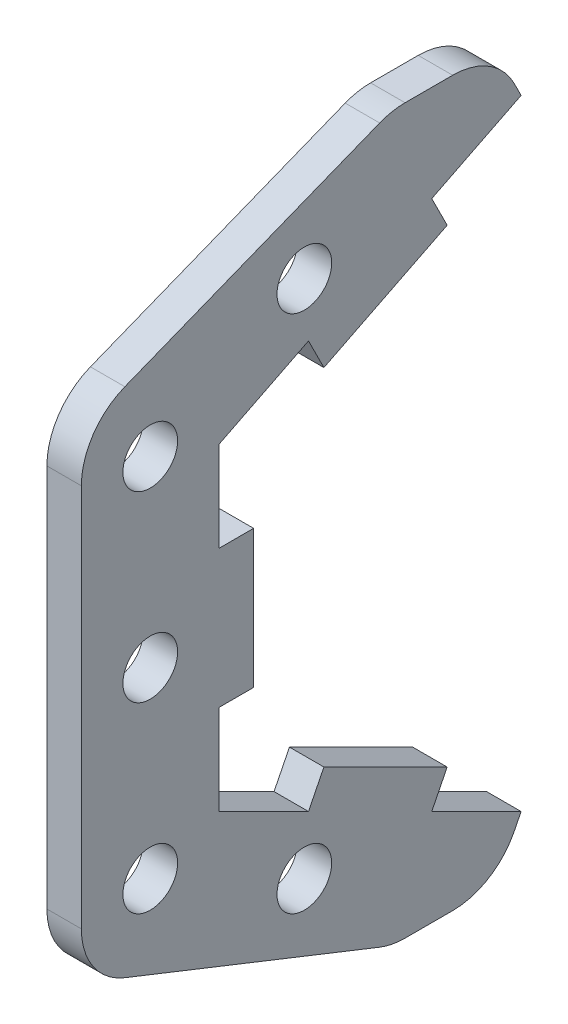
ISO-10303-21;
HEADER;
FILE_DESCRIPTION(('STEP AP214'),'2;1');
FILE_NAME('part.step','',(''),(''),'','','');
FILE_SCHEMA(('AUTOMOTIVE_DESIGN { 1 0 10303 214 1 1 1 1 }'));
ENDSEC;
DATA;
#1=APPLICATION_CONTEXT('core data for automotive mechanical design processes');
#2=APPLICATION_PROTOCOL_DEFINITION('international standard','automotive_design',2000,#1);
#3=PRODUCT_CONTEXT('',#1,'mechanical');
#4=PRODUCT('Part','Part','',(#3));
#5=PRODUCT_RELATED_PRODUCT_CATEGORY('part','',(#4));
#6=PRODUCT_DEFINITION_FORMATION('','',#4);
#7=PRODUCT_DEFINITION_CONTEXT('part definition',#1,'design');
#8=PRODUCT_DEFINITION('design','',#6,#7);
#9=PRODUCT_DEFINITION_SHAPE('','',#8);
#10=(LENGTH_UNIT() NAMED_UNIT(*) SI_UNIT(.MILLI.,.METRE.));
#11=(NAMED_UNIT(*) PLANE_ANGLE_UNIT() SI_UNIT($,.RADIAN.));
#12=(NAMED_UNIT(*) SI_UNIT($,.STERADIAN.) SOLID_ANGLE_UNIT());
#13=UNCERTAINTY_MEASURE_WITH_UNIT(LENGTH_MEASURE(1.E-05),#10,'distance_accuracy_value','');
#14=(GEOMETRIC_REPRESENTATION_CONTEXT(3) GLOBAL_UNCERTAINTY_ASSIGNED_CONTEXT((#13)) GLOBAL_UNIT_ASSIGNED_CONTEXT((#10,
#11,#12)) REPRESENTATION_CONTEXT('',''));
#15=CARTESIAN_POINT('',(0.,0.,0.));
#16=DIRECTION('',(0.,0.,1.));
#17=DIRECTION('',(1.,0.,0.));
#18=AXIS2_PLACEMENT_3D('',#15,#16,#17);
#19=CARTESIAN_POINT('',(6.35,110.581612662849,55.2908063314247));
#20=DIRECTION('',(0.,0.894427190999916,0.447213595499958));
#21=DIRECTION('',(0.,-0.447213595499958,0.894427190999916));
#22=AXIS2_PLACEMENT_3D('',#19,#20,#21);
#23=PLANE('',#22);
#24=DIRECTION('',(0.,-0.447213595499958,0.894427190999916));
#25=VECTOR('',#24,1.);
#26=CARTESIAN_POINT('',(12.7,110.581612662849,55.2908063314247));
#27=LINE('',#26,#25);
#28=CARTESIAN_POINT('',(12.7,57.15,162.154031657124));
#29=VERTEX_POINT('',#28);
#30=CARTESIAN_POINT('',(12.7,48.9168705771304,178.620290502863));
#31=VERTEX_POINT('',#30);
#32=EDGE_CURVE('E230',#29,#31,#27,.T.);
#33=ORIENTED_EDGE('',*,*,#32,.T.);
#34=DIRECTION('',(1.,0.,0.));
#35=VECTOR('',#34,1.);
#36=CARTESIAN_POINT('',(-24.3672020210175,48.9168705771304,178.620290502863));
#37=LINE('',#36,#35);
#38=CARTESIAN_POINT('',(6.35,48.9168705771304,178.620290502863));
#39=VERTEX_POINT('',#38);
#40=EDGE_CURVE('E58',#39,#31,#37,.T.);
#41=ORIENTED_EDGE('',*,*,#40,.F.);
#42=DIRECTION('',(0.,-0.447213595499958,0.894427190999916));
#43=VECTOR('',#42,1.);
#44=CARTESIAN_POINT('',(6.35,110.581612662849,55.2908063314247));
#45=LINE('',#44,#43);
#46=CARTESIAN_POINT('',(6.35,57.15,162.154031657124));
#47=VERTEX_POINT('',#46);
#48=EDGE_CURVE('E359',#47,#39,#45,.T.);
#49=ORIENTED_EDGE('',*,*,#48,.F.);
#50=DIRECTION('',(1.,0.,0.));
#51=VECTOR('',#50,1.);
#52=CARTESIAN_POINT('',(6.35,57.15,162.154031657124));
#53=LINE('',#52,#51);
#54=EDGE_CURVE('E397',#47,#29,#53,.T.);
#55=ORIENTED_EDGE('',*,*,#54,.T.);
#56=EDGE_LOOP('',(#33,#41,#49,#55));
#57=FACE_BOUND('',#56,.T.);
#58=ADVANCED_FACE('F35',(#57),#23,.F.);
#59=CARTESIAN_POINT('',(6.35,-110.581612662849,55.2908063314247));
#60=DIRECTION('',(0.,-0.894427190999916,0.447213595499958));
#61=DIRECTION('',(0.,-0.447213595499958,-0.894427190999916));
#62=AXIS2_PLACEMENT_3D('',#59,#60,#61);
#63=PLANE('',#62);
#64=DIRECTION('',(0.,-0.447213595499958,-0.894427190999916));
#65=VECTOR('',#64,1.);
#66=CARTESIAN_POINT('',(12.7,-110.581612662849,55.2908063314247));
#67=LINE('',#66,#65);
#68=CARTESIAN_POINT('',(12.7,-29.3245158285618,217.805));
#69=VERTEX_POINT('',#68);
#70=CARTESIAN_POINT('',(12.7,-37.5576452514315,201.338741154261));
#71=VERTEX_POINT('',#70);
#72=EDGE_CURVE('E383',#69,#71,#67,.T.);
#73=ORIENTED_EDGE('',*,*,#72,.T.);
#74=DIRECTION('',(1.,0.,0.));
#75=VECTOR('',#74,1.);
#76=CARTESIAN_POINT('',(-24.3672020210175,-37.5576452514315,201.338741154261));
#77=LINE('',#76,#75);
#78=CARTESIAN_POINT('',(6.35,-37.5576452514315,201.338741154261));
#79=VERTEX_POINT('',#78);
#80=EDGE_CURVE('E263',#79,#71,#77,.T.);
#81=ORIENTED_EDGE('',*,*,#80,.F.);
#82=DIRECTION('',(0.,-0.447213595499958,-0.894427190999916));
#83=VECTOR('',#82,1.);
#84=CARTESIAN_POINT('',(6.35,-110.581612662849,55.2908063314247));
#85=LINE('',#84,#83);
#86=CARTESIAN_POINT('',(6.35,-29.3245158285618,217.805));
#87=VERTEX_POINT('',#86);
#88=EDGE_CURVE('E352',#87,#79,#85,.T.);
#89=ORIENTED_EDGE('',*,*,#88,.F.);
#90=DIRECTION('',(1.,0.,0.));
#91=VECTOR('',#90,1.);
#92=CARTESIAN_POINT('',(6.35,-29.3245158285618,217.805));
#93=LINE('',#92,#91);
#94=EDGE_CURVE('E402',#87,#69,#93,.T.);
#95=ORIENTED_EDGE('',*,*,#94,.T.);
#96=EDGE_LOOP('',(#73,#81,#89,#95));
#97=FACE_BOUND('',#96,.T.);
#98=ADVANCED_FACE('F536',(#97),#63,.F.);
#99=CARTESIAN_POINT('',(6.35,0.,217.805));
#100=DIRECTION('',(0.,0.,1.));
#101=DIRECTION('',(1.,0.,0.));
#102=AXIS2_PLACEMENT_3D('',#99,#100,#101);
#103=PLANE('',#102);
#104=DIRECTION('',(0.,-1.,0.));
#105=VECTOR('',#104,1.);
#106=CARTESIAN_POINT('',(12.7,0.,217.805));
#107=LINE('',#106,#105);
#108=CARTESIAN_POINT('',(12.7,29.3245158285619,217.805));
#109=VERTEX_POINT('',#108);
#110=CARTESIAN_POINT('',(12.7,12.7,217.805));
#111=VERTEX_POINT('',#110);
#112=EDGE_CURVE('E228',#109,#111,#107,.T.);
#113=ORIENTED_EDGE('',*,*,#112,.T.);
#114=DIRECTION('',(1.,0.,0.));
#115=VECTOR('',#114,1.);
#116=CARTESIAN_POINT('',(-24.3672020210175,12.7,217.805));
#117=LINE('',#116,#115);
#118=CARTESIAN_POINT('',(6.35,12.7,217.805));
#119=VERTEX_POINT('',#118);
#120=EDGE_CURVE('E289',#119,#111,#117,.T.);
#121=ORIENTED_EDGE('',*,*,#120,.F.);
#122=DIRECTION('',(0.,-1.,0.));
#123=VECTOR('',#122,1.);
#124=CARTESIAN_POINT('',(6.35,0.,217.805));
#125=LINE('',#124,#123);
#126=CARTESIAN_POINT('',(6.35,29.3245158285619,217.805));
#127=VERTEX_POINT('',#126);
#128=EDGE_CURVE('E356',#127,#119,#125,.T.);
#129=ORIENTED_EDGE('',*,*,#128,.F.);
#130=DIRECTION('',(1.,0.,0.));
#131=VECTOR('',#130,1.);
#132=CARTESIAN_POINT('',(6.35,29.3245158285619,217.805));
#133=LINE('',#132,#131);
#134=EDGE_CURVE('E400',#127,#109,#133,.T.);
#135=ORIENTED_EDGE('',*,*,#134,.T.);
#136=EDGE_LOOP('',(#113,#121,#129,#135));
#137=FACE_BOUND('',#136,.T.);
#138=ADVANCED_FACE('F556',(#137),#103,.F.);
#139=CARTESIAN_POINT('',(6.35,-121.32277142173,48.0848399848919));
#140=DIRECTION('',(0.,-0.929645930646482,0.368454126903793));
#141=DIRECTION('',(0.,-0.368454126903793,-0.929645930646482));
#142=AXIS2_PLACEMENT_3D('',#139,#140,#141);
#143=PLANE('',#142);
#144=DIRECTION('',(0.,-0.368454126903794,-0.929645930646482));
#145=VECTOR('',#144,1.);
#146=CARTESIAN_POINT('',(12.7,-121.32277142173,48.0848399848919));
#147=LINE('',#146,#145);
#148=CARTESIAN_POINT('',(12.7,-47.1680951632006,235.184367411678));
#149=VERTEX_POINT('',#148);
#150=CARTESIAN_POINT('',(12.7,-65.7815033192103,188.220911490842));
#151=VERTEX_POINT('',#150);
#152=EDGE_CURVE('E340',#149,#151,#147,.T.);
#153=ORIENTED_EDGE('',*,*,#152,.F.);
#154=DIRECTION('',(1.,0.,0.));
#155=VECTOR('',#154,1.);
#156=CARTESIAN_POINT('',(6.35,-47.1680951632006,235.184367411678));
#157=LINE('',#156,#155);
#158=CARTESIAN_POINT('',(6.35,-47.1680951632006,235.184367411678));
#159=VERTEX_POINT('',#158);
#160=EDGE_CURVE('E443',#149,#159,#157,.F.);
#161=ORIENTED_EDGE('',*,*,#160,.T.);
#162=DIRECTION('',(0.,-0.368454126903794,-0.929645930646482));
#163=VECTOR('',#162,1.);
#164=CARTESIAN_POINT('',(6.35,-121.32277142173,48.0848399848919));
#165=LINE('',#164,#163);
#166=CARTESIAN_POINT('',(6.35,-65.7815033192103,188.220911490842));
#167=VERTEX_POINT('',#166);
#168=EDGE_CURVE('E341',#159,#167,#165,.T.);
#169=ORIENTED_EDGE('',*,*,#168,.T.);
#170=DIRECTION('',(1.,0.,0.));
#171=VECTOR('',#170,1.);
#172=CARTESIAN_POINT('',(6.35,-65.7815033192103,188.220911490842));
#173=LINE('',#172,#171);
#174=EDGE_CURVE('E440',#167,#151,#173,.T.);
#175=ORIENTED_EDGE('',*,*,#174,.T.);
#176=EDGE_LOOP('',(#153,#161,#169,#175));
#177=FACE_BOUND('',#176,.T.);
#178=ADVANCED_FACE('F497',(#177),#143,.T.);
#179=CARTESIAN_POINT('',(6.35,0.,243.205));
#180=DIRECTION('',(0.,0.,1.));
#181=DIRECTION('',(1.,0.,0.));
#182=AXIS2_PLACEMENT_3D('',#179,#180,#181);
#183=PLANE('',#182);
#184=DIRECTION('',(0.,-1.,0.));
#185=VECTOR('',#184,1.);
#186=CARTESIAN_POINT('',(12.7,0.,243.205));
#187=LINE('',#186,#185);
#188=CARTESIAN_POINT('',(12.7,35.3615918439905,243.205));
#189=VERTEX_POINT('',#188);
#190=CARTESIAN_POINT('',(12.7,-35.3615918439903,243.205));
#191=VERTEX_POINT('',#190);
#192=EDGE_CURVE('E345',#189,#191,#187,.T.);
#193=ORIENTED_EDGE('',*,*,#192,.F.);
#194=DIRECTION('',(1.,0.,0.));
#195=VECTOR('',#194,1.);
#196=CARTESIAN_POINT('',(6.35,35.3615918439905,243.205));
#197=LINE('',#196,#195);
#198=CARTESIAN_POINT('',(6.35,35.3615918439905,243.205));
#199=VERTEX_POINT('',#198);
#200=EDGE_CURVE('E426',#189,#199,#197,.F.);
#201=ORIENTED_EDGE('',*,*,#200,.T.);
#202=DIRECTION('',(0.,-1.,0.));
#203=VECTOR('',#202,1.);
#204=CARTESIAN_POINT('',(6.35,0.,243.205));
#205=LINE('',#204,#203);
#206=CARTESIAN_POINT('',(6.35,-35.3615918439903,243.205));
#207=VERTEX_POINT('',#206);
#208=EDGE_CURVE('E370',#199,#207,#205,.T.);
#209=ORIENTED_EDGE('',*,*,#208,.T.);
#210=DIRECTION('',(1.,0.,0.));
#211=VECTOR('',#210,1.);
#212=CARTESIAN_POINT('',(6.35,-35.3615918439903,243.205));
#213=LINE('',#212,#211);
#214=EDGE_CURVE('E423',#207,#191,#213,.T.);
#215=ORIENTED_EDGE('',*,*,#214,.T.);
#216=EDGE_LOOP('',(#193,#201,#209,#215));
#217=FACE_BOUND('',#216,.T.);
#218=ADVANCED_FACE('F486',(#217),#183,.T.);
#219=CARTESIAN_POINT('',(6.35,121.322771421729,48.084839984891));
#220=DIRECTION('',(0.,0.929645930646483,0.368454126903789));
#221=DIRECTION('',(0.,-0.368454126903789,0.929645930646484));
#222=AXIS2_PLACEMENT_3D('',#219,#220,#221);
#223=PLANE('',#222);
#224=DIRECTION('',(0.,-0.368454126903789,0.929645930646484));
#225=VECTOR('',#224,1.);
#226=CARTESIAN_POINT('',(6.35,121.322771421729,48.084839984891));
#227=LINE('',#226,#225);
#228=CARTESIAN_POINT('',(6.35,65.7815033192103,188.220911490842));
#229=VERTEX_POINT('',#228);
#230=CARTESIAN_POINT('',(6.35,47.1680951632009,235.184367411678));
#231=VERTEX_POINT('',#230);
#232=EDGE_CURVE('E367',#229,#231,#227,.T.);
#233=ORIENTED_EDGE('',*,*,#232,.T.);
#234=DIRECTION('',(1.,0.,0.));
#235=VECTOR('',#234,1.);
#236=CARTESIAN_POINT('',(6.35,47.1680951632009,235.184367411678));
#237=LINE('',#236,#235);
#238=CARTESIAN_POINT('',(12.7,47.1680951632009,235.184367411678));
#239=VERTEX_POINT('',#238);
#240=EDGE_CURVE('E408',#231,#239,#237,.T.);
#241=ORIENTED_EDGE('',*,*,#240,.T.);
#242=DIRECTION('',(0.,-0.368454126903789,0.929645930646484));
#243=VECTOR('',#242,1.);
#244=CARTESIAN_POINT('',(12.7,121.322771421729,48.084839984891));
#245=LINE('',#244,#243);
#246=CARTESIAN_POINT('',(12.7,65.7815033192103,188.220911490842));
#247=VERTEX_POINT('',#246);
#248=EDGE_CURVE('E393',#247,#239,#245,.T.);
#249=ORIENTED_EDGE('',*,*,#248,.F.);
#250=DIRECTION('',(1.,0.,0.));
#251=VECTOR('',#250,1.);
#252=CARTESIAN_POINT('',(6.35,65.7815033192103,188.220911490842));
#253=LINE('',#252,#251);
#254=EDGE_CURVE('E399',#247,#229,#253,.F.);
#255=ORIENTED_EDGE('',*,*,#254,.T.);
#256=EDGE_LOOP('',(#233,#241,#249,#255));
#257=FACE_BOUND('',#256,.T.);
#258=ADVANCED_FACE('F480',(#257),#223,.T.);
#259=CARTESIAN_POINT('',(6.35,66.6750000000001,0.));
#260=DIRECTION('',(0.,1.,0.));
#261=DIRECTION('',(0.,0.,1.));
#262=AXIS2_PLACEMENT_3D('',#259,#260,#261);
#263=PLANE('',#262);
#264=DIRECTION('',(0.,0.,1.));
#265=VECTOR('',#264,1.);
#266=CARTESIAN_POINT('',(12.7,66.6750000000001,0.));
#267=LINE('',#266,#265);
#268=CARTESIAN_POINT('',(12.7,66.675,174.765563314247));
#269=VERTEX_POINT('',#268);
#270=CARTESIAN_POINT('',(12.7,66.6749999999999,183.541544079164));
#271=VERTEX_POINT('',#270);
#272=EDGE_CURVE('E390',#269,#271,#267,.T.);
#273=ORIENTED_EDGE('',*,*,#272,.F.);
#274=DIRECTION('',(1.,0.,0.));
#275=VECTOR('',#274,1.);
#276=CARTESIAN_POINT('',(6.35,66.675,174.765563314247));
#277=LINE('',#276,#275);
#278=CARTESIAN_POINT('',(6.35,66.675,174.765563314247));
#279=VERTEX_POINT('',#278);
#280=EDGE_CURVE('E11',#269,#279,#277,.F.);
#281=ORIENTED_EDGE('',*,*,#280,.T.);
#282=DIRECTION('',(0.,0.,1.));
#283=VECTOR('',#282,1.);
#284=CARTESIAN_POINT('',(6.35,66.6750000000001,0.));
#285=LINE('',#284,#283);
#286=CARTESIAN_POINT('',(6.35,66.6749999999999,183.541544079164));
#287=VERTEX_POINT('',#286);
#288=EDGE_CURVE('E364',#279,#287,#285,.T.);
#289=ORIENTED_EDGE('',*,*,#288,.T.);
#290=DIRECTION('',(1.,0.,0.));
#291=VECTOR('',#290,1.);
#292=CARTESIAN_POINT('',(6.35,66.6749999999999,183.541544079164));
#293=LINE('',#292,#291);
#294=EDGE_CURVE('E43',#287,#271,#293,.T.);
#295=ORIENTED_EDGE('',*,*,#294,.T.);
#296=EDGE_LOOP('',(#273,#281,#289,#295));
#297=FACE_BOUND('',#296,.T.);
#298=ADVANCED_FACE('F458',(#297),#263,.T.);
#299=CARTESIAN_POINT('',(6.35,-53.4316126628494,106.863225325699));
#300=DIRECTION('',(0.,0.447213595499958,-0.894427190999916));
#301=DIRECTION('',(0.,0.894427190999916,0.447213595499958));
#302=AXIS2_PLACEMENT_3D('',#299,#300,#301);
#303=PLANE('',#302);
#304=DIRECTION('',(0.,0.894427190999916,0.447213595499958));
#305=VECTOR('',#304,1.);
#306=CARTESIAN_POINT('',(6.35,-53.4316126628494,106.863225325699));
#307=LINE('',#306,#305);
#308=CARTESIAN_POINT('',(6.35,59.6546126628494,163.406337988548));
#309=VERTEX_POINT('',#308);
#310=EDGE_CURVE('E361',#47,#309,#307,.T.);
#311=ORIENTED_EDGE('',*,*,#310,.T.);
#312=DIRECTION('',(1.,0.,0.));
#313=VECTOR('',#312,1.);
#314=CARTESIAN_POINT('',(6.35,59.6546126628494,163.406337988548));
#315=LINE('',#314,#313);
#316=CARTESIAN_POINT('',(12.7,59.6546126628494,163.406337988548));
#317=VERTEX_POINT('',#316);
#318=EDGE_CURVE('E452',#309,#317,#315,.T.);
#319=ORIENTED_EDGE('',*,*,#318,.T.);
#320=DIRECTION('',(0.,0.894427190999916,0.447213595499958));
#321=VECTOR('',#320,1.);
#322=CARTESIAN_POINT('',(12.7,-53.4316126628494,106.863225325699));
#323=LINE('',#322,#321);
#324=EDGE_CURVE('E387',#29,#317,#323,.T.);
#325=ORIENTED_EDGE('',*,*,#324,.F.);
#326=ORIENTED_EDGE('',*,*,#54,.F.);
#327=EDGE_LOOP('',(#311,#319,#325,#326));
#328=FACE_BOUND('',#327,.T.);
#329=ADVANCED_FACE('F471',(#328),#303,.T.);
#330=CARTESIAN_POINT('',(6.35,37.5576452514315,201.338741154261));
#331=VERTEX_POINT('',#330);
#332=EDGE_CURVE('E50',#331,#127,#45,.T.);
#333=ORIENTED_EDGE('',*,*,#332,.F.);
#334=DIRECTION('',(1.,0.,0.));
#335=VECTOR('',#334,1.);
#336=CARTESIAN_POINT('',(-24.3672020210175,37.5576452514315,201.338741154261));
#337=LINE('',#336,#335);
#338=CARTESIAN_POINT('',(12.7,37.5576452514315,201.338741154261));
#339=VERTEX_POINT('',#338);
#340=EDGE_CURVE('E233',#331,#339,#337,.T.);
#341=ORIENTED_EDGE('',*,*,#340,.T.);
#342=EDGE_CURVE('E221',#339,#109,#27,.T.);
#343=ORIENTED_EDGE('',*,*,#342,.T.);
#344=ORIENTED_EDGE('',*,*,#134,.F.);
#345=EDGE_LOOP('',(#333,#341,#343,#344));
#346=FACE_BOUND('',#345,.T.);
#347=ADVANCED_FACE('F234',(#346),#23,.F.);
#348=CARTESIAN_POINT('',(6.35,-12.7,217.805));
#349=VERTEX_POINT('',#348);
#350=EDGE_CURVE('E355',#349,#87,#125,.T.);
#351=ORIENTED_EDGE('',*,*,#350,.F.);
#352=DIRECTION('',(1.,0.,0.));
#353=VECTOR('',#352,1.);
#354=CARTESIAN_POINT('',(-24.3672020210175,-12.7,217.805));
#355=LINE('',#354,#353);
#356=CARTESIAN_POINT('',(12.7,-12.7,217.805));
#357=VERTEX_POINT('',#356);
#358=EDGE_CURVE('E299',#349,#357,#355,.T.);
#359=ORIENTED_EDGE('',*,*,#358,.T.);
#360=EDGE_CURVE('E385',#357,#69,#107,.T.);
#361=ORIENTED_EDGE('',*,*,#360,.T.);
#362=ORIENTED_EDGE('',*,*,#94,.F.);
#363=EDGE_LOOP('',(#351,#359,#361,#362));
#364=FACE_BOUND('',#363,.T.);
#365=ADVANCED_FACE('F540',(#364),#103,.F.);
#366=CARTESIAN_POINT('',(6.35,-48.9168705771304,178.620290502863));
#367=VERTEX_POINT('',#366);
#368=CARTESIAN_POINT('',(6.35,-57.15,162.154031657124));
#369=VERTEX_POINT('',#368);
#370=EDGE_CURVE('E351',#367,#369,#85,.T.);
#371=ORIENTED_EDGE('',*,*,#370,.F.);
#372=DIRECTION('',(1.,0.,0.));
#373=VECTOR('',#372,1.);
#374=CARTESIAN_POINT('',(-24.3672020210175,-48.9168705771304,178.620290502863));
#375=LINE('',#374,#373);
#376=CARTESIAN_POINT('',(12.7,-48.9168705771304,178.620290502863));
#377=VERTEX_POINT('',#376);
#378=EDGE_CURVE('E274',#367,#377,#375,.T.);
#379=ORIENTED_EDGE('',*,*,#378,.T.);
#380=CARTESIAN_POINT('',(12.7,-57.15,162.154031657124));
#381=VERTEX_POINT('',#380);
#382=EDGE_CURVE('E382',#377,#381,#67,.T.);
#383=ORIENTED_EDGE('',*,*,#382,.T.);
#384=DIRECTION('',(1.,0.,0.));
#385=VECTOR('',#384,1.);
#386=CARTESIAN_POINT('',(6.35,-57.15,162.154031657124));
#387=LINE('',#386,#385);
#388=EDGE_CURVE('E373',#369,#381,#387,.T.);
#389=ORIENTED_EDGE('',*,*,#388,.F.);
#390=EDGE_LOOP('',(#371,#379,#383,#389));
#391=FACE_BOUND('',#390,.T.);
#392=ADVANCED_FACE('F518',(#391),#63,.F.);
#393=CARTESIAN_POINT('',(6.35,53.4316126628493,106.863225325699));
#394=DIRECTION('',(0.,-0.447213595499956,-0.894427190999917));
#395=DIRECTION('',(0.,0.894427190999917,-0.447213595499956));
#396=AXIS2_PLACEMENT_3D('',#393,#394,#395);
#397=PLANE('',#396);
#398=DIRECTION('',(0.,0.894427190999917,-0.447213595499956));
#399=VECTOR('',#398,1.);
#400=CARTESIAN_POINT('',(12.7,53.4316126628493,106.863225325699));
#401=LINE('',#400,#399);
#402=CARTESIAN_POINT('',(12.7,-59.6546126628495,163.406337988548));
#403=VERTEX_POINT('',#402);
#404=EDGE_CURVE('E379',#403,#381,#401,.T.);
#405=ORIENTED_EDGE('',*,*,#404,.F.);
#406=DIRECTION('',(1.,0.,0.));
#407=VECTOR('',#406,1.);
#408=CARTESIAN_POINT('',(6.35,-59.6546126628494,163.406337988548));
#409=LINE('',#408,#407);
#410=CARTESIAN_POINT('',(6.35,-59.6546126628495,163.406337988548));
#411=VERTEX_POINT('',#410);
#412=EDGE_CURVE('E450',#403,#411,#409,.F.);
#413=ORIENTED_EDGE('',*,*,#412,.T.);
#414=DIRECTION('',(0.,0.894427190999917,-0.447213595499956));
#415=VECTOR('',#414,1.);
#416=CARTESIAN_POINT('',(6.35,53.4316126628493,106.863225325699));
#417=LINE('',#416,#415);
#418=EDGE_CURVE('E348',#411,#369,#417,.T.);
#419=ORIENTED_EDGE('',*,*,#418,.T.);
#420=ORIENTED_EDGE('',*,*,#388,.T.);
#421=EDGE_LOOP('',(#405,#413,#419,#420));
#422=FACE_BOUND('',#421,.T.);
#423=ADVANCED_FACE('F514',(#422),#397,.T.);
#424=CARTESIAN_POINT('',(6.35,-66.675,0.));
#425=DIRECTION('',(0.,-1.,0.));
#426=DIRECTION('',(0.,0.,-1.));
#427=AXIS2_PLACEMENT_3D('',#424,#425,#426);
#428=PLANE('',#427);
#429=DIRECTION('',(0.,0.,-1.));
#430=VECTOR('',#429,1.);
#431=CARTESIAN_POINT('',(6.35,-66.675,0.));
#432=LINE('',#431,#430);
#433=CARTESIAN_POINT('',(6.35,-66.675,183.541544079164));
#434=VERTEX_POINT('',#433);
#435=CARTESIAN_POINT('',(6.35,-66.675,174.765563314247));
#436=VERTEX_POINT('',#435);
#437=EDGE_CURVE('E344',#434,#436,#432,.T.);
#438=ORIENTED_EDGE('',*,*,#437,.T.);
#439=DIRECTION('',(1.,0.,0.));
#440=VECTOR('',#439,1.);
#441=CARTESIAN_POINT('',(6.35,-66.675,174.765563314247));
#442=LINE('',#441,#440);
#443=CARTESIAN_POINT('',(12.7,-66.675,174.765563314247));
#444=VERTEX_POINT('',#443);
#445=EDGE_CURVE('E447',#436,#444,#442,.T.);
#446=ORIENTED_EDGE('',*,*,#445,.T.);
#447=DIRECTION('',(0.,0.,-1.));
#448=VECTOR('',#447,1.);
#449=CARTESIAN_POINT('',(12.7,-66.675,0.));
#450=LINE('',#449,#448);
#451=CARTESIAN_POINT('',(12.7,-66.675,183.541544079164));
#452=VERTEX_POINT('',#451);
#453=EDGE_CURVE('E376',#452,#444,#450,.T.);
#454=ORIENTED_EDGE('',*,*,#453,.F.);
#455=DIRECTION('',(1.,0.,0.));
#456=VECTOR('',#455,1.);
#457=CARTESIAN_POINT('',(6.35,-66.675,183.541544079164));
#458=LINE('',#457,#456);
#459=EDGE_CURVE('E445',#452,#434,#458,.F.);
#460=ORIENTED_EDGE('',*,*,#459,.T.);
#461=EDGE_LOOP('',(#438,#446,#454,#460));
#462=FACE_BOUND('',#461,.T.);
#463=ADVANCED_FACE('F505',(#462),#428,.T.);
#464=CARTESIAN_POINT('',(6.35,0.,0.));
#465=DIRECTION('',(1.,0.,0.));
#466=DIRECTION('',(0.,0.,-1.));
#467=AXIS2_PLACEMENT_3D('',#464,#465,#466);
#468=PLANE('',#467);
#469=CARTESIAN_POINT('',(6.35,1.11022302462516E-13,230.505));
#470=DIRECTION('',(1.,0.,0.));
#471=DIRECTION('',(0.,0.,-1.));
#472=AXIS2_PLACEMENT_3D('',#469,#470,#471);
#473=CIRCLE('',#472,5.04189999999999);
#474=CARTESIAN_POINT('',(6.35,1.11022302462516E-13,225.4631));
#475=VERTEX_POINT('',#474);
#476=EDGE_CURVE('E313',#475,#475,#473,.T.);
#477=ORIENTED_EDGE('',*,*,#476,.T.);
#478=EDGE_LOOP('',(#477));
#479=FACE_BOUND('',#478,.T.);
#480=CARTESIAN_POINT('',(6.35,33.6901408285618,230.505));
#481=DIRECTION('',(1.,0.,0.));
#482=DIRECTION('',(0.,0.,-1.));
#483=AXIS2_PLACEMENT_3D('',#480,#481,#482);
#484=CIRCLE('',#483,5.04189999999999);
#485=CARTESIAN_POINT('',(6.35,33.6901408285618,225.4631));
#486=VERTEX_POINT('',#485);
#487=EDGE_CURVE('E319',#486,#486,#484,.T.);
#488=ORIENTED_EDGE('',*,*,#487,.T.);
#489=EDGE_LOOP('',(#488));
#490=FACE_BOUND('',#489,.T.);
#491=CARTESIAN_POINT('',(6.35,47.8891724856854,202.106936685753));
#492=DIRECTION('',(1.,0.,0.));
#493=DIRECTION('',(0.,0.,-1.));
#494=AXIS2_PLACEMENT_3D('',#491,#492,#493);
#495=CIRCLE('',#494,5.04189999999999);
#496=CARTESIAN_POINT('',(6.35,47.8891724856854,197.065036685753));
#497=VERTEX_POINT('',#496);
#498=EDGE_CURVE('E325',#497,#497,#495,.T.);
#499=ORIENTED_EDGE('',*,*,#498,.T.);
#500=EDGE_LOOP('',(#499));
#501=FACE_BOUND('',#500,.T.);
#502=CARTESIAN_POINT('',(6.35,-33.6901408285617,230.505));
#503=DIRECTION('',(1.,0.,0.));
#504=DIRECTION('',(0.,0.,-1.));
#505=AXIS2_PLACEMENT_3D('',#502,#503,#504);
#506=CIRCLE('',#505,5.04189999999999);
#507=CARTESIAN_POINT('',(6.35,-33.6901408285617,225.4631));
#508=VERTEX_POINT('',#507);
#509=EDGE_CURVE('E331',#508,#508,#506,.T.);
#510=ORIENTED_EDGE('',*,*,#509,.T.);
#511=EDGE_LOOP('',(#510));
#512=FACE_BOUND('',#511,.T.);
#513=CARTESIAN_POINT('',(6.35,-47.8891724856855,202.106936685753));
#514=DIRECTION('',(1.,0.,0.));
#515=DIRECTION('',(0.,0.,-1.));
#516=AXIS2_PLACEMENT_3D('',#513,#514,#515);
#517=CIRCLE('',#516,5.04189999999999);
#518=CARTESIAN_POINT('',(6.35,-47.8891724856855,197.065036685753));
#519=VERTEX_POINT('',#518);
#520=EDGE_CURVE('E337',#519,#519,#517,.T.);
#521=ORIENTED_EDGE('',*,*,#520,.T.);
#522=EDGE_LOOP('',(#521));
#523=FACE_BOUND('',#522,.T.);
#524=ORIENTED_EDGE('',*,*,#208,.F.);
#525=CARTESIAN_POINT('',(6.35,35.3615918439905,230.505));
#526=DIRECTION('',(1.,0.,0.));
#527=DIRECTION('',(0.,0.,-1.));
#528=AXIS2_PLACEMENT_3D('',#525,#526,#527);
#529=CIRCLE('',#528,12.7);
#530=EDGE_CURVE('E438',#199,#231,#529,.F.);
#531=ORIENTED_EDGE('',*,*,#530,.T.);
#532=ORIENTED_EDGE('',*,*,#232,.F.);
#533=CARTESIAN_POINT('',(6.35,53.9749999999999,183.541544079164));
#534=DIRECTION('',(1.,0.,0.));
#535=DIRECTION('',(0.,0.,-1.));
#536=AXIS2_PLACEMENT_3D('',#533,#534,#535);
#537=CIRCLE('',#536,12.7);
#538=EDGE_CURVE('E428',#229,#287,#537,.F.);
#539=ORIENTED_EDGE('',*,*,#538,.T.);
#540=ORIENTED_EDGE('',*,*,#288,.F.);
#541=CARTESIAN_POINT('',(6.35,53.9749999999999,174.765563314247));
#542=DIRECTION('',(1.,0.,0.));
#543=DIRECTION('',(0.,0.,-1.));
#544=AXIS2_PLACEMENT_3D('',#541,#542,#543);
#545=CIRCLE('',#544,12.7);
#546=EDGE_CURVE('E430',#279,#309,#545,.F.);
#547=ORIENTED_EDGE('',*,*,#546,.T.);
#548=ORIENTED_EDGE('',*,*,#310,.F.);
#549=ORIENTED_EDGE('',*,*,#48,.T.);
#550=DIRECTION('',(0.,-0.894427190999917,-0.447213595499956));
#551=VECTOR('',#550,1.);
#552=CARTESIAN_POINT('',(6.35,43.2372579142809,175.780484171438));
#553=LINE('',#552,#551);
#554=CARTESIAN_POINT('',(6.35,43.2372579142809,175.780484171438));
#555=VERTEX_POINT('',#554);
#556=EDGE_CURVE('E247',#39,#555,#553,.T.);
#557=ORIENTED_EDGE('',*,*,#556,.T.);
#558=DIRECTION('',(0.,-0.447213595499957,0.894427190999917));
#559=VECTOR('',#558,1.);
#560=CARTESIAN_POINT('',(6.35,31.878032588582,198.498934822836));
#561=LINE('',#560,#559);
#562=CARTESIAN_POINT('',(6.35,31.878032588582,198.498934822836));
#563=VERTEX_POINT('',#562);
#564=EDGE_CURVE('E253',#555,#563,#561,.T.);
#565=ORIENTED_EDGE('',*,*,#564,.T.);
#566=DIRECTION('',(0.,0.894427190999917,0.447213595499957));
#567=VECTOR('',#566,1.);
#568=CARTESIAN_POINT('',(6.35,37.5576452514315,201.338741154261));
#569=LINE('',#568,#567);
#570=EDGE_CURVE('E257',#563,#331,#569,.T.);
#571=ORIENTED_EDGE('',*,*,#570,.T.);
#572=ORIENTED_EDGE('',*,*,#332,.T.);
#573=ORIENTED_EDGE('',*,*,#128,.T.);
#574=DIRECTION('',(0.,0.,-1.));
#575=VECTOR('',#574,1.);
#576=CARTESIAN_POINT('',(6.35,12.7,217.805));
#577=LINE('',#576,#575);
#578=CARTESIAN_POINT('',(6.35,12.7,211.455));
#579=VERTEX_POINT('',#578);
#580=EDGE_CURVE('E288',#119,#579,#577,.T.);
#581=ORIENTED_EDGE('',*,*,#580,.T.);
#582=DIRECTION('',(0.,-1.,0.));
#583=VECTOR('',#582,1.);
#584=CARTESIAN_POINT('',(6.35,12.7,211.455));
#585=LINE('',#584,#583);
#586=CARTESIAN_POINT('',(6.35,-12.7,211.455));
#587=VERTEX_POINT('',#586);
#588=EDGE_CURVE('E286',#579,#587,#585,.T.);
#589=ORIENTED_EDGE('',*,*,#588,.T.);
#590=DIRECTION('',(0.,0.,1.));
#591=VECTOR('',#590,1.);
#592=CARTESIAN_POINT('',(6.35,-12.7,217.805));
#593=LINE('',#592,#591);
#594=EDGE_CURVE('E291',#587,#349,#593,.T.);
#595=ORIENTED_EDGE('',*,*,#594,.T.);
#596=ORIENTED_EDGE('',*,*,#350,.T.);
#597=ORIENTED_EDGE('',*,*,#88,.T.);
#598=DIRECTION('',(0.,0.894427190999917,-0.447213595499956));
#599=VECTOR('',#598,1.);
#600=CARTESIAN_POINT('',(6.35,-31.878032588582,198.498934822836));
#601=LINE('',#600,#599);
#602=CARTESIAN_POINT('',(6.35,-31.878032588582,198.498934822836));
#603=VERTEX_POINT('',#602);
#604=EDGE_CURVE('E262',#79,#603,#601,.T.);
#605=ORIENTED_EDGE('',*,*,#604,.T.);
#606=DIRECTION('',(0.,-0.447213595499958,-0.894427190999916));
#607=VECTOR('',#606,1.);
#608=CARTESIAN_POINT('',(6.35,-43.2372579142809,175.780484171438));
#609=LINE('',#608,#607);
#610=CARTESIAN_POINT('',(6.35,-43.2372579142809,175.780484171438));
#611=VERTEX_POINT('',#610);
#612=EDGE_CURVE('E260',#603,#611,#609,.T.);
#613=ORIENTED_EDGE('',*,*,#612,.T.);
#614=DIRECTION('',(0.,-0.894427190999919,0.447213595499953));
#615=VECTOR('',#614,1.);
#616=CARTESIAN_POINT('',(6.35,-48.9168705771304,178.620290502863));
#617=LINE('',#616,#615);
#618=EDGE_CURVE('E265',#611,#367,#617,.T.);
#619=ORIENTED_EDGE('',*,*,#618,.T.);
#620=ORIENTED_EDGE('',*,*,#370,.T.);
#621=ORIENTED_EDGE('',*,*,#418,.F.);
#622=CARTESIAN_POINT('',(6.35,-53.975,174.765563314247));
#623=DIRECTION('',(1.,0.,0.));
#624=DIRECTION('',(0.,0.,-1.));
#625=AXIS2_PLACEMENT_3D('',#622,#623,#624);
#626=CIRCLE('',#625,12.7);
#627=EDGE_CURVE('E434',#411,#436,#626,.F.);
#628=ORIENTED_EDGE('',*,*,#627,.T.);
#629=ORIENTED_EDGE('',*,*,#437,.F.);
#630=CARTESIAN_POINT('',(6.35,-53.975,183.541544079164));
#631=DIRECTION('',(1.,0.,0.));
#632=DIRECTION('',(0.,0.,-1.));
#633=AXIS2_PLACEMENT_3D('',#630,#631,#632);
#634=CIRCLE('',#633,12.7);
#635=EDGE_CURVE('E432',#434,#167,#634,.F.);
#636=ORIENTED_EDGE('',*,*,#635,.T.);
#637=ORIENTED_EDGE('',*,*,#168,.F.);
#638=CARTESIAN_POINT('',(6.35,-35.3615918439903,230.505));
#639=DIRECTION('',(1.,0.,0.));
#640=DIRECTION('',(0.,0.,-1.));
#641=AXIS2_PLACEMENT_3D('',#638,#639,#640);
#642=CIRCLE('',#641,12.7);
#643=EDGE_CURVE('E436',#159,#207,#642,.F.);
#644=ORIENTED_EDGE('',*,*,#643,.T.);
#645=EDGE_LOOP('',(#524,#531,#532,#539,#540,#547,#548,#549,#557,#565,#571,#572,#573,#581,#589,
#595,#596,#597,#605,#613,#619,#620,#621,#628,#629,#636,#637,#644));
#646=FACE_BOUND('',#645,.T.);
#647=ADVANCED_FACE('F475',(#479,#490,#501,#512,#523,#646),#468,.F.);
#648=CARTESIAN_POINT('',(12.7,0.,0.));
#649=DIRECTION('',(1.,0.,0.));
#650=DIRECTION('',(0.,0.,-1.));
#651=AXIS2_PLACEMENT_3D('',#648,#649,#650);
#652=PLANE('',#651);
#653=CARTESIAN_POINT('',(12.7,1.11022302462516E-13,230.505));
#654=DIRECTION('',(1.,0.,0.));
#655=DIRECTION('',(0.,0.,-1.));
#656=AXIS2_PLACEMENT_3D('',#653,#654,#655);
#657=CIRCLE('',#656,5.04189999999999);
#658=CARTESIAN_POINT('',(12.7,1.11022302462516E-13,225.4631));
#659=VERTEX_POINT('',#658);
#660=EDGE_CURVE('E310',#659,#659,#657,.T.);
#661=ORIENTED_EDGE('',*,*,#660,.F.);
#662=EDGE_LOOP('',(#661));
#663=FACE_BOUND('',#662,.T.);
#664=CARTESIAN_POINT('',(12.7,33.6901408285618,230.505));
#665=DIRECTION('',(1.,0.,0.));
#666=DIRECTION('',(0.,0.,-1.));
#667=AXIS2_PLACEMENT_3D('',#664,#665,#666);
#668=CIRCLE('',#667,5.04189999999999);
#669=CARTESIAN_POINT('',(12.7,33.6901408285618,225.4631));
#670=VERTEX_POINT('',#669);
#671=EDGE_CURVE('E316',#670,#670,#668,.T.);
#672=ORIENTED_EDGE('',*,*,#671,.F.);
#673=EDGE_LOOP('',(#672));
#674=FACE_BOUND('',#673,.T.);
#675=CARTESIAN_POINT('',(12.7,47.8891724856854,202.106936685753));
#676=DIRECTION('',(1.,0.,0.));
#677=DIRECTION('',(0.,0.,-1.));
#678=AXIS2_PLACEMENT_3D('',#675,#676,#677);
#679=CIRCLE('',#678,5.04189999999999);
#680=CARTESIAN_POINT('',(12.7,47.8891724856854,197.065036685753));
#681=VERTEX_POINT('',#680);
#682=EDGE_CURVE('E322',#681,#681,#679,.T.);
#683=ORIENTED_EDGE('',*,*,#682,.F.);
#684=EDGE_LOOP('',(#683));
#685=FACE_BOUND('',#684,.T.);
#686=CARTESIAN_POINT('',(12.7,-33.6901408285617,230.505));
#687=DIRECTION('',(1.,0.,0.));
#688=DIRECTION('',(0.,0.,-1.));
#689=AXIS2_PLACEMENT_3D('',#686,#687,#688);
#690=CIRCLE('',#689,5.04189999999999);
#691=CARTESIAN_POINT('',(12.7,-33.6901408285617,225.4631));
#692=VERTEX_POINT('',#691);
#693=EDGE_CURVE('E328',#692,#692,#690,.T.);
#694=ORIENTED_EDGE('',*,*,#693,.F.);
#695=EDGE_LOOP('',(#694));
#696=FACE_BOUND('',#695,.T.);
#697=CARTESIAN_POINT('',(12.7,-47.8891724856855,202.106936685753));
#698=DIRECTION('',(1.,0.,0.));
#699=DIRECTION('',(0.,0.,-1.));
#700=AXIS2_PLACEMENT_3D('',#697,#698,#699);
#701=CIRCLE('',#700,5.04189999999999);
#702=CARTESIAN_POINT('',(12.7,-47.8891724856855,197.065036685753));
#703=VERTEX_POINT('',#702);
#704=EDGE_CURVE('E334',#703,#703,#701,.T.);
#705=ORIENTED_EDGE('',*,*,#704,.F.);
#706=EDGE_LOOP('',(#705));
#707=FACE_BOUND('',#706,.T.);
#708=ORIENTED_EDGE('',*,*,#248,.T.);
#709=CARTESIAN_POINT('',(12.7,35.3615918439905,230.505));
#710=DIRECTION('',(1.,0.,0.));
#711=DIRECTION('',(0.,0.,-1.));
#712=AXIS2_PLACEMENT_3D('',#709,#710,#711);
#713=CIRCLE('',#712,12.7);
#714=EDGE_CURVE('E421',#239,#189,#713,.T.);
#715=ORIENTED_EDGE('',*,*,#714,.T.);
#716=ORIENTED_EDGE('',*,*,#192,.T.);
#717=CARTESIAN_POINT('',(12.7,-35.3615918439903,230.505));
#718=DIRECTION('',(1.,0.,0.));
#719=DIRECTION('',(0.,0.,-1.));
#720=AXIS2_PLACEMENT_3D('',#717,#718,#719);
#721=CIRCLE('',#720,12.7);
#722=EDGE_CURVE('E419',#191,#149,#721,.T.);
#723=ORIENTED_EDGE('',*,*,#722,.T.);
#724=ORIENTED_EDGE('',*,*,#152,.T.);
#725=CARTESIAN_POINT('',(12.7,-53.975,183.541544079164));
#726=DIRECTION('',(1.,0.,0.));
#727=DIRECTION('',(0.,0.,-1.));
#728=AXIS2_PLACEMENT_3D('',#725,#726,#727);
#729=CIRCLE('',#728,12.7);
#730=EDGE_CURVE('E415',#151,#452,#729,.T.);
#731=ORIENTED_EDGE('',*,*,#730,.T.);
#732=ORIENTED_EDGE('',*,*,#453,.T.);
#733=CARTESIAN_POINT('',(12.7,-53.975,174.765563314247));
#734=DIRECTION('',(1.,0.,0.));
#735=DIRECTION('',(0.,0.,-1.));
#736=AXIS2_PLACEMENT_3D('',#733,#734,#735);
#737=CIRCLE('',#736,12.7);
#738=EDGE_CURVE('E417',#444,#403,#737,.T.);
#739=ORIENTED_EDGE('',*,*,#738,.T.);
#740=ORIENTED_EDGE('',*,*,#404,.T.);
#741=ORIENTED_EDGE('',*,*,#382,.F.);
#742=DIRECTION('',(0.,0.894427190999918,-0.447213595499953));
#743=VECTOR('',#742,1.);
#744=CARTESIAN_POINT('',(12.7,-48.9168705771304,178.620290502863));
#745=LINE('',#744,#743);
#746=CARTESIAN_POINT('',(12.7,-43.2372579142809,175.780484171438));
#747=VERTEX_POINT('',#746);
#748=EDGE_CURVE('E259',#377,#747,#745,.T.);
#749=ORIENTED_EDGE('',*,*,#748,.T.);
#750=DIRECTION('',(0.,0.447213595499958,0.894427190999916));
#751=VECTOR('',#750,1.);
#752=CARTESIAN_POINT('',(12.7,-43.2372579142809,175.780484171438));
#753=LINE('',#752,#751);
#754=CARTESIAN_POINT('',(12.7,-31.878032588582,198.498934822836));
#755=VERTEX_POINT('',#754);
#756=EDGE_CURVE('E268',#747,#755,#753,.T.);
#757=ORIENTED_EDGE('',*,*,#756,.T.);
#758=DIRECTION('',(0.,-0.894427190999917,0.447213595499956));
#759=VECTOR('',#758,1.);
#760=CARTESIAN_POINT('',(12.7,-31.878032588582,198.498934822836));
#761=LINE('',#760,#759);
#762=EDGE_CURVE('E271',#755,#71,#761,.T.);
#763=ORIENTED_EDGE('',*,*,#762,.T.);
#764=ORIENTED_EDGE('',*,*,#72,.F.);
#765=ORIENTED_EDGE('',*,*,#360,.F.);
#766=DIRECTION('',(0.,0.,-1.));
#767=VECTOR('',#766,1.);
#768=CARTESIAN_POINT('',(12.7,-12.7,217.805));
#769=LINE('',#768,#767);
#770=CARTESIAN_POINT('',(12.7,-12.7,211.455));
#771=VERTEX_POINT('',#770);
#772=EDGE_CURVE('E285',#357,#771,#769,.T.);
#773=ORIENTED_EDGE('',*,*,#772,.T.);
#774=DIRECTION('',(0.,1.,0.));
#775=VECTOR('',#774,1.);
#776=CARTESIAN_POINT('',(12.7,12.7,211.455));
#777=LINE('',#776,#775);
#778=CARTESIAN_POINT('',(12.7,12.7,211.455));
#779=VERTEX_POINT('',#778);
#780=EDGE_CURVE('E294',#771,#779,#777,.T.);
#781=ORIENTED_EDGE('',*,*,#780,.T.);
#782=DIRECTION('',(0.,0.,1.));
#783=VECTOR('',#782,1.);
#784=CARTESIAN_POINT('',(12.7,12.7,217.805));
#785=LINE('',#784,#783);
#786=EDGE_CURVE('E297',#779,#111,#785,.T.);
#787=ORIENTED_EDGE('',*,*,#786,.T.);
#788=ORIENTED_EDGE('',*,*,#112,.F.);
#789=ORIENTED_EDGE('',*,*,#342,.F.);
#790=DIRECTION('',(0.,-0.894427190999917,-0.447213595499957));
#791=VECTOR('',#790,1.);
#792=CARTESIAN_POINT('',(12.7,37.5576452514315,201.338741154261));
#793=LINE('',#792,#791);
#794=CARTESIAN_POINT('',(12.7,31.878032588582,198.498934822836));
#795=VERTEX_POINT('',#794);
#796=EDGE_CURVE('E226',#339,#795,#793,.T.);
#797=ORIENTED_EDGE('',*,*,#796,.T.);
#798=DIRECTION('',(0.,0.447213595499957,-0.894427190999916));
#799=VECTOR('',#798,1.);
#800=CARTESIAN_POINT('',(12.7,31.878032588582,198.498934822836));
#801=LINE('',#800,#799);
#802=CARTESIAN_POINT('',(12.7,43.2372579142809,175.780484171438));
#803=VERTEX_POINT('',#802);
#804=EDGE_CURVE('E243',#795,#803,#801,.T.);
#805=ORIENTED_EDGE('',*,*,#804,.T.);
#806=DIRECTION('',(0.,0.894427190999917,0.447213595499956));
#807=VECTOR('',#806,1.);
#808=CARTESIAN_POINT('',(12.7,43.2372579142809,175.780484171438));
#809=LINE('',#808,#807);
#810=EDGE_CURVE('E238',#803,#31,#809,.T.);
#811=ORIENTED_EDGE('',*,*,#810,.T.);
#812=ORIENTED_EDGE('',*,*,#32,.F.);
#813=ORIENTED_EDGE('',*,*,#324,.T.);
#814=CARTESIAN_POINT('',(12.7,53.9749999999999,174.765563314247));
#815=DIRECTION('',(1.,0.,0.));
#816=DIRECTION('',(0.,0.,-1.));
#817=AXIS2_PLACEMENT_3D('',#814,#815,#816);
#818=CIRCLE('',#817,12.7);
#819=EDGE_CURVE('E413',#317,#269,#818,.T.);
#820=ORIENTED_EDGE('',*,*,#819,.T.);
#821=ORIENTED_EDGE('',*,*,#272,.T.);
#822=CARTESIAN_POINT('',(12.7,53.9749999999999,183.541544079164));
#823=DIRECTION('',(1.,0.,0.));
#824=DIRECTION('',(0.,0.,-1.));
#825=AXIS2_PLACEMENT_3D('',#822,#823,#824);
#826=CIRCLE('',#825,12.7);
#827=EDGE_CURVE('E411',#271,#247,#826,.T.);
#828=ORIENTED_EDGE('',*,*,#827,.T.);
#829=EDGE_LOOP('',(#708,#715,#716,#723,#724,#731,#732,#739,#740,#741,#749,#757,#763,#764,#765,
#773,#781,#787,#788,#789,#797,#805,#811,#812,#813,#820,#821,#828));
#830=FACE_BOUND('',#829,.T.);
#831=ADVANCED_FACE('F223',(#663,#674,#685,#696,#707,#830),#652,.T.);
#832=CARTESIAN_POINT('',(12.7,-47.8891724856855,202.106936685753));
#833=DIRECTION('',(1.,0.,0.));
#834=DIRECTION('',(0.,0.,-1.));
#835=AXIS2_PLACEMENT_3D('',#832,#833,#834);
#836=CYLINDRICAL_SURFACE('',#835,5.04189999999999);
#837=ORIENTED_EDGE('',*,*,#704,.T.);
#838=EDGE_LOOP('',(#837));
#839=FACE_BOUND('',#838,.T.);
#840=ORIENTED_EDGE('',*,*,#520,.F.);
#841=EDGE_LOOP('',(#840));
#842=FACE_BOUND('',#841,.T.);
#843=ADVANCED_FACE('F599',(#839,#842),#836,.F.);
#844=CARTESIAN_POINT('',(12.7,-33.6901408285617,230.505));
#845=DIRECTION('',(1.,0.,0.));
#846=DIRECTION('',(0.,0.,-1.));
#847=AXIS2_PLACEMENT_3D('',#844,#845,#846);
#848=CYLINDRICAL_SURFACE('',#847,5.04189999999999);
#849=ORIENTED_EDGE('',*,*,#693,.T.);
#850=EDGE_LOOP('',(#849));
#851=FACE_BOUND('',#850,.T.);
#852=ORIENTED_EDGE('',*,*,#509,.F.);
#853=EDGE_LOOP('',(#852));
#854=FACE_BOUND('',#853,.T.);
#855=ADVANCED_FACE('F606',(#851,#854),#848,.F.);
#856=CARTESIAN_POINT('',(12.7,47.8891724856854,202.106936685753));
#857=DIRECTION('',(1.,0.,0.));
#858=DIRECTION('',(0.,0.,-1.));
#859=AXIS2_PLACEMENT_3D('',#856,#857,#858);
#860=CYLINDRICAL_SURFACE('',#859,5.04189999999999);
#861=ORIENTED_EDGE('',*,*,#682,.T.);
#862=EDGE_LOOP('',(#861));
#863=FACE_BOUND('',#862,.T.);
#864=ORIENTED_EDGE('',*,*,#498,.F.);
#865=EDGE_LOOP('',(#864));
#866=FACE_BOUND('',#865,.T.);
#867=ADVANCED_FACE('F610',(#863,#866),#860,.F.);
#868=CARTESIAN_POINT('',(12.7,33.6901408285618,230.505));
#869=DIRECTION('',(1.,0.,0.));
#870=DIRECTION('',(0.,0.,-1.));
#871=AXIS2_PLACEMENT_3D('',#868,#869,#870);
#872=CYLINDRICAL_SURFACE('',#871,5.04189999999999);
#873=ORIENTED_EDGE('',*,*,#671,.T.);
#874=EDGE_LOOP('',(#873));
#875=FACE_BOUND('',#874,.T.);
#876=ORIENTED_EDGE('',*,*,#487,.F.);
#877=EDGE_LOOP('',(#876));
#878=FACE_BOUND('',#877,.T.);
#879=ADVANCED_FACE('F614',(#875,#878),#872,.F.);
#880=CARTESIAN_POINT('',(12.7,1.11022302462516E-13,230.505));
#881=DIRECTION('',(1.,0.,0.));
#882=DIRECTION('',(0.,0.,-1.));
#883=AXIS2_PLACEMENT_3D('',#880,#881,#882);
#884=CYLINDRICAL_SURFACE('',#883,5.04189999999999);
#885=ORIENTED_EDGE('',*,*,#660,.T.);
#886=EDGE_LOOP('',(#885));
#887=FACE_BOUND('',#886,.T.);
#888=ORIENTED_EDGE('',*,*,#476,.F.);
#889=EDGE_LOOP('',(#888));
#890=FACE_BOUND('',#889,.T.);
#891=ADVANCED_FACE('F618',(#887,#890),#884,.F.);
#892=CARTESIAN_POINT('',(6.35,35.3615918439905,230.505));
#893=DIRECTION('',(1.,0.,0.));
#894=DIRECTION('',(0.,0.,-1.));
#895=AXIS2_PLACEMENT_3D('',#892,#893,#894);
#896=CYLINDRICAL_SURFACE('',#895,12.7);
#897=ORIENTED_EDGE('',*,*,#530,.F.);
#898=ORIENTED_EDGE('',*,*,#200,.F.);
#899=ORIENTED_EDGE('',*,*,#714,.F.);
#900=ORIENTED_EDGE('',*,*,#240,.F.);
#901=EDGE_LOOP('',(#897,#898,#899,#900));
#902=FACE_BOUND('',#901,.T.);
#903=ADVANCED_FACE('F489',(#902),#896,.T.);
#904=CARTESIAN_POINT('',(6.35,-35.3615918439903,230.505));
#905=DIRECTION('',(1.,0.,0.));
#906=DIRECTION('',(0.,0.,-1.));
#907=AXIS2_PLACEMENT_3D('',#904,#905,#906);
#908=CYLINDRICAL_SURFACE('',#907,12.7);
#909=ORIENTED_EDGE('',*,*,#643,.F.);
#910=ORIENTED_EDGE('',*,*,#160,.F.);
#911=ORIENTED_EDGE('',*,*,#722,.F.);
#912=ORIENTED_EDGE('',*,*,#214,.F.);
#913=EDGE_LOOP('',(#909,#910,#911,#912));
#914=FACE_BOUND('',#913,.T.);
#915=ADVANCED_FACE('F493',(#914),#908,.T.);
#916=CARTESIAN_POINT('',(6.35,-53.975,174.765563314247));
#917=DIRECTION('',(1.,0.,0.));
#918=DIRECTION('',(0.,0.,-1.));
#919=AXIS2_PLACEMENT_3D('',#916,#917,#918);
#920=CYLINDRICAL_SURFACE('',#919,12.7);
#921=ORIENTED_EDGE('',*,*,#627,.F.);
#922=ORIENTED_EDGE('',*,*,#412,.F.);
#923=ORIENTED_EDGE('',*,*,#738,.F.);
#924=ORIENTED_EDGE('',*,*,#445,.F.);
#925=EDGE_LOOP('',(#921,#922,#923,#924));
#926=FACE_BOUND('',#925,.T.);
#927=ADVANCED_FACE('F510',(#926),#920,.T.);
#928=CARTESIAN_POINT('',(6.35,-53.975,183.541544079164));
#929=DIRECTION('',(1.,0.,0.));
#930=DIRECTION('',(0.,0.,-1.));
#931=AXIS2_PLACEMENT_3D('',#928,#929,#930);
#932=CYLINDRICAL_SURFACE('',#931,12.7);
#933=ORIENTED_EDGE('',*,*,#635,.F.);
#934=ORIENTED_EDGE('',*,*,#459,.F.);
#935=ORIENTED_EDGE('',*,*,#730,.F.);
#936=ORIENTED_EDGE('',*,*,#174,.F.);
#937=EDGE_LOOP('',(#933,#934,#935,#936));
#938=FACE_BOUND('',#937,.T.);
#939=ADVANCED_FACE('F501',(#938),#932,.T.);
#940=CARTESIAN_POINT('',(6.35,53.9749999999999,174.765563314247));
#941=DIRECTION('',(1.,0.,0.));
#942=DIRECTION('',(0.,0.,-1.));
#943=AXIS2_PLACEMENT_3D('',#940,#941,#942);
#944=CYLINDRICAL_SURFACE('',#943,12.7);
#945=ORIENTED_EDGE('',*,*,#546,.F.);
#946=ORIENTED_EDGE('',*,*,#280,.F.);
#947=ORIENTED_EDGE('',*,*,#819,.F.);
#948=ORIENTED_EDGE('',*,*,#318,.F.);
#949=EDGE_LOOP('',(#945,#946,#947,#948));
#950=FACE_BOUND('',#949,.T.);
#951=ADVANCED_FACE('F469',(#950),#944,.T.);
#952=CARTESIAN_POINT('',(6.35,53.9749999999999,183.541544079164));
#953=DIRECTION('',(1.,0.,0.));
#954=DIRECTION('',(0.,0.,-1.));
#955=AXIS2_PLACEMENT_3D('',#952,#953,#954);
#956=CYLINDRICAL_SURFACE('',#955,12.7);
#957=ORIENTED_EDGE('',*,*,#538,.F.);
#958=ORIENTED_EDGE('',*,*,#254,.F.);
#959=ORIENTED_EDGE('',*,*,#827,.F.);
#960=ORIENTED_EDGE('',*,*,#294,.F.);
#961=EDGE_LOOP('',(#957,#958,#959,#960));
#962=FACE_BOUND('',#961,.T.);
#963=ADVANCED_FACE('F37',(#962),#956,.T.);
#964=CARTESIAN_POINT('',(-24.3672020210175,12.7,217.805));
#965=DIRECTION('',(0.,1.,0.));
#966=DIRECTION('',(0.,0.,1.));
#967=AXIS2_PLACEMENT_3D('',#964,#965,#966);
#968=PLANE('',#967);
#969=ORIENTED_EDGE('',*,*,#580,.F.);
#970=ORIENTED_EDGE('',*,*,#120,.T.);
#971=ORIENTED_EDGE('',*,*,#786,.F.);
#972=DIRECTION('',(1.,0.,0.));
#973=VECTOR('',#972,1.);
#974=CARTESIAN_POINT('',(-24.3672020210175,12.7,211.455));
#975=LINE('',#974,#973);
#976=EDGE_CURVE('E302',#579,#779,#975,.T.);
#977=ORIENTED_EDGE('',*,*,#976,.F.);
#978=EDGE_LOOP('',(#969,#970,#971,#977));
#979=FACE_BOUND('',#978,.T.);
#980=ADVANCED_FACE('F553',(#979),#968,.T.);
#981=CARTESIAN_POINT('',(-24.3672020210175,12.7,211.455));
#982=DIRECTION('',(0.,0.,-1.));
#983=DIRECTION('',(0.,1.,0.));
#984=AXIS2_PLACEMENT_3D('',#981,#982,#983);
#985=PLANE('',#984);
#986=ORIENTED_EDGE('',*,*,#588,.F.);
#987=ORIENTED_EDGE('',*,*,#976,.T.);
#988=ORIENTED_EDGE('',*,*,#780,.F.);
#989=DIRECTION('',(1.,0.,0.));
#990=VECTOR('',#989,1.);
#991=CARTESIAN_POINT('',(-24.3672020210175,-12.7,211.455));
#992=LINE('',#991,#990);
#993=EDGE_CURVE('E304',#587,#771,#992,.T.);
#994=ORIENTED_EDGE('',*,*,#993,.F.);
#995=EDGE_LOOP('',(#986,#987,#988,#994));
#996=FACE_BOUND('',#995,.T.);
#997=ADVANCED_FACE('F625',(#996),#985,.T.);
#998=CARTESIAN_POINT('',(-24.3672020210175,-12.7,217.805));
#999=DIRECTION('',(0.,-1.,0.));
#1000=DIRECTION('',(0.,0.,-1.));
#1001=AXIS2_PLACEMENT_3D('',#998,#999,#1000);
#1002=PLANE('',#1001);
#1003=ORIENTED_EDGE('',*,*,#594,.F.);
#1004=ORIENTED_EDGE('',*,*,#993,.T.);
#1005=ORIENTED_EDGE('',*,*,#772,.F.);
#1006=ORIENTED_EDGE('',*,*,#358,.F.);
#1007=EDGE_LOOP('',(#1003,#1004,#1005,#1006));
#1008=FACE_BOUND('',#1007,.T.);
#1009=ADVANCED_FACE('F545',(#1008),#1002,.T.);
#1010=CARTESIAN_POINT('',(-24.3672020210175,-31.878032588582,198.498934822836));
#1011=DIRECTION('',(0.,0.447213595499956,0.894427190999917));
#1012=DIRECTION('',(0.,-0.894427190999917,0.447213595499956));
#1013=AXIS2_PLACEMENT_3D('',#1010,#1011,#1012);
#1014=PLANE('',#1013);
#1015=ORIENTED_EDGE('',*,*,#604,.F.);
#1016=ORIENTED_EDGE('',*,*,#80,.T.);
#1017=ORIENTED_EDGE('',*,*,#762,.F.);
#1018=DIRECTION('',(1.,0.,0.));
#1019=VECTOR('',#1018,1.);
#1020=CARTESIAN_POINT('',(-24.3672020210175,-31.878032588582,198.498934822836));
#1021=LINE('',#1020,#1019);
#1022=EDGE_CURVE('E277',#603,#755,#1021,.T.);
#1023=ORIENTED_EDGE('',*,*,#1022,.F.);
#1024=EDGE_LOOP('',(#1015,#1016,#1017,#1023));
#1025=FACE_BOUND('',#1024,.T.);
#1026=ADVANCED_FACE('F533',(#1025),#1014,.T.);
#1027=CARTESIAN_POINT('',(-24.3672020210175,-43.2372579142809,175.780484171438));
#1028=DIRECTION('',(0.,0.894427190999916,-0.447213595499958));
#1029=DIRECTION('',(0.,0.447213595499958,0.894427190999916));
#1030=AXIS2_PLACEMENT_3D('',#1027,#1028,#1029);
#1031=PLANE('',#1030);
#1032=ORIENTED_EDGE('',*,*,#612,.F.);
#1033=ORIENTED_EDGE('',*,*,#1022,.T.);
#1034=ORIENTED_EDGE('',*,*,#756,.F.);
#1035=DIRECTION('',(1.,0.,0.));
#1036=VECTOR('',#1035,1.);
#1037=CARTESIAN_POINT('',(-24.3672020210175,-43.2372579142809,175.780484171438));
#1038=LINE('',#1037,#1036);
#1039=EDGE_CURVE('E279',#611,#747,#1038,.T.);
#1040=ORIENTED_EDGE('',*,*,#1039,.F.);
#1041=EDGE_LOOP('',(#1032,#1033,#1034,#1040));
#1042=FACE_BOUND('',#1041,.T.);
#1043=ADVANCED_FACE('F529',(#1042),#1031,.T.);
#1044=CARTESIAN_POINT('',(-24.3672020210175,-48.9168705771304,178.620290502863));
#1045=DIRECTION('',(0.,-0.447213595499953,-0.894427190999919));
#1046=DIRECTION('',(0.,0.894427190999919,-0.447213595499953));
#1047=AXIS2_PLACEMENT_3D('',#1044,#1045,#1046);
#1048=PLANE('',#1047);
#1049=ORIENTED_EDGE('',*,*,#618,.F.);
#1050=ORIENTED_EDGE('',*,*,#1039,.T.);
#1051=ORIENTED_EDGE('',*,*,#748,.F.);
#1052=ORIENTED_EDGE('',*,*,#378,.F.);
#1053=EDGE_LOOP('',(#1049,#1050,#1051,#1052));
#1054=FACE_BOUND('',#1053,.T.);
#1055=ADVANCED_FACE('F525',(#1054),#1048,.T.);
#1056=CARTESIAN_POINT('',(-24.3672020210175,43.2372579142809,175.780484171438));
#1057=DIRECTION('',(0.,0.447213595499956,-0.894427190999917));
#1058=DIRECTION('',(0.,0.894427190999917,0.447213595499956));
#1059=AXIS2_PLACEMENT_3D('',#1056,#1057,#1058);
#1060=PLANE('',#1059);
#1061=ORIENTED_EDGE('',*,*,#556,.F.);
#1062=ORIENTED_EDGE('',*,*,#40,.T.);
#1063=ORIENTED_EDGE('',*,*,#810,.F.);
#1064=DIRECTION('',(1.,0.,0.));
#1065=VECTOR('',#1064,1.);
#1066=CARTESIAN_POINT('',(-24.3672020210175,43.2372579142809,175.780484171438));
#1067=LINE('',#1066,#1065);
#1068=EDGE_CURVE('E254',#555,#803,#1067,.T.);
#1069=ORIENTED_EDGE('',*,*,#1068,.F.);
#1070=EDGE_LOOP('',(#1061,#1062,#1063,#1069));
#1071=FACE_BOUND('',#1070,.T.);
#1072=ADVANCED_FACE('F564',(#1071),#1060,.T.);
#1073=CARTESIAN_POINT('',(-24.3672020210175,31.878032588582,198.498934822836));
#1074=DIRECTION('',(0.,-0.894427190999916,-0.447213595499957));
#1075=DIRECTION('',(0.,0.447213595499957,-0.894427190999917));
#1076=AXIS2_PLACEMENT_3D('',#1073,#1074,#1075);
#1077=PLANE('',#1076);
#1078=ORIENTED_EDGE('',*,*,#564,.F.);
#1079=ORIENTED_EDGE('',*,*,#1068,.T.);
#1080=ORIENTED_EDGE('',*,*,#804,.F.);
#1081=DIRECTION('',(1.,0.,0.));
#1082=VECTOR('',#1081,1.);
#1083=CARTESIAN_POINT('',(-24.3672020210175,31.878032588582,198.498934822836));
#1084=LINE('',#1083,#1082);
#1085=EDGE_CURVE('E237',#563,#795,#1084,.T.);
#1086=ORIENTED_EDGE('',*,*,#1085,.F.);
#1087=EDGE_LOOP('',(#1078,#1079,#1080,#1086));
#1088=FACE_BOUND('',#1087,.T.);
#1089=ADVANCED_FACE('F561',(#1088),#1077,.T.);
#1090=CARTESIAN_POINT('',(-24.3672020210175,37.5576452514315,201.338741154261));
#1091=DIRECTION('',(0.,-0.447213595499957,0.894427190999916));
#1092=DIRECTION('',(0.,-0.894427190999917,-0.447213595499957));
#1093=AXIS2_PLACEMENT_3D('',#1090,#1091,#1092);
#1094=PLANE('',#1093);
#1095=ORIENTED_EDGE('',*,*,#570,.F.);
#1096=ORIENTED_EDGE('',*,*,#1085,.T.);
#1097=ORIENTED_EDGE('',*,*,#796,.F.);
#1098=ORIENTED_EDGE('',*,*,#340,.F.);
#1099=EDGE_LOOP('',(#1095,#1096,#1097,#1098));
#1100=FACE_BOUND('',#1099,.T.);
#1101=ADVANCED_FACE('F240',(#1100),#1094,.T.);
#1102=CLOSED_SHELL('',(#58,#98,#138,#178,#218,#258,#298,#329,#347,#365,#392,#423,#463,#647,#831,
#843,#855,#867,#879,#891,#903,#915,#927,#939,#951,#963,#980,#997,#1009,#1026,#1043,#1055,#1072,
#1089,#1101));
#1103=MANIFOLD_SOLID_BREP('B2',#1102);
#1104=ADVANCED_BREP_SHAPE_REPRESENTATION('',(#18,#1103),#14);
#1105=SHAPE_DEFINITION_REPRESENTATION(#9,#1104);
ENDSEC;
END-ISO-10303-21;
